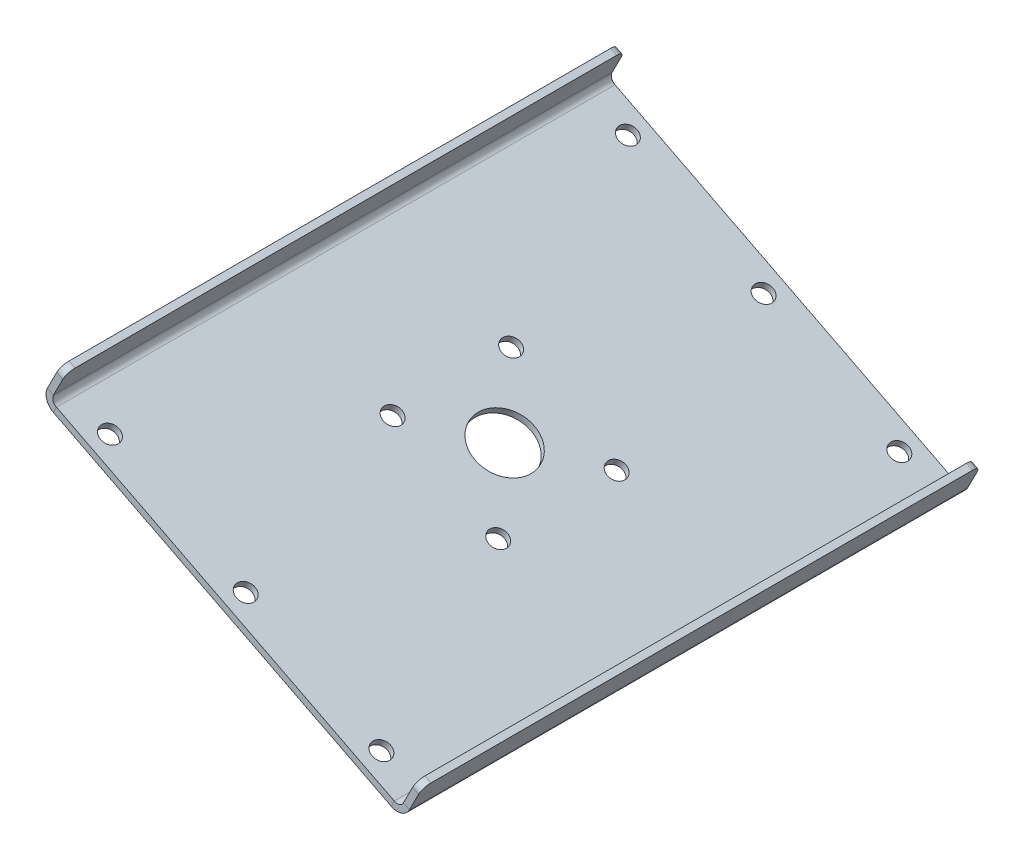
ISO-10303-21;
HEADER;
FILE_DESCRIPTION(('STEP AP214'),'2;1');
FILE_NAME('part.step','',(''),(''),'','','');
FILE_SCHEMA(('AUTOMOTIVE_DESIGN { 1 0 10303 214 1 1 1 1 }'));
ENDSEC;
DATA;
#1=APPLICATION_CONTEXT('core data for automotive mechanical design processes');
#2=APPLICATION_PROTOCOL_DEFINITION('international standard','automotive_design',2000,#1);
#3=PRODUCT_CONTEXT('',#1,'mechanical');
#4=PRODUCT('Part','Part','',(#3));
#5=PRODUCT_RELATED_PRODUCT_CATEGORY('part','',(#4));
#6=PRODUCT_DEFINITION_FORMATION('','',#4);
#7=PRODUCT_DEFINITION_CONTEXT('part definition',#1,'design');
#8=PRODUCT_DEFINITION('design','',#6,#7);
#9=PRODUCT_DEFINITION_SHAPE('','',#8);
#10=(LENGTH_UNIT() NAMED_UNIT(*) SI_UNIT(.MILLI.,.METRE.));
#11=(NAMED_UNIT(*) PLANE_ANGLE_UNIT() SI_UNIT($,.RADIAN.));
#12=(NAMED_UNIT(*) SI_UNIT($,.STERADIAN.) SOLID_ANGLE_UNIT());
#13=UNCERTAINTY_MEASURE_WITH_UNIT(LENGTH_MEASURE(1.E-05),#10,'distance_accuracy_value','');
#14=(GEOMETRIC_REPRESENTATION_CONTEXT(3) GLOBAL_UNCERTAINTY_ASSIGNED_CONTEXT((#13)) GLOBAL_UNIT_ASSIGNED_CONTEXT((#10,
#11,#12)) REPRESENTATION_CONTEXT('',''));
#15=CARTESIAN_POINT('',(0.,0.,0.));
#16=DIRECTION('',(0.,0.,1.));
#17=DIRECTION('',(1.,0.,0.));
#18=AXIS2_PLACEMENT_3D('',#15,#16,#17);
#19=CARTESIAN_POINT('',(1798.40944660311,3785.08922779486,-165.000000000083));
#20=DIRECTION('',(0.453990499739544,0.891006524188369,0.));
#21=DIRECTION('',(0.,0.,1.));
#22=AXIS2_PLACEMENT_3D('',#19,#20,#21);
#23=PLANE('',#22);
#24=DIRECTION('',(0.,0.,1.));
#25=VECTOR('',#24,1.);
#26=CARTESIAN_POINT('',(1798.40944660311,3785.08922779486,-165.000000000083));
#27=LINE('',#26,#25);
#28=CARTESIAN_POINT('',(1798.40944660311,3785.08922779486,159.999999999999));
#29=VERTEX_POINT('',#28);
#30=CARTESIAN_POINT('',(1798.40944660311,3785.08922779486,-160.000000000083));
#31=VERTEX_POINT('',#30);
#32=EDGE_CURVE('E231',#29,#31,#27,.F.);
#33=ORIENTED_EDGE('',*,*,#32,.T.);
#34=DIRECTION('',(0.891006524188369,-0.453990499739545,0.));
#35=VECTOR('',#34,1.);
#36=CARTESIAN_POINT('',(1798.40944660311,3785.08922779486,-160.000000000083));
#37=LINE('',#36,#35);
#38=CARTESIAN_POINT('',(1794.84542050636,3786.90518979382,-160.000000000083));
#39=VERTEX_POINT('',#38);
#40=EDGE_CURVE('E73',#31,#39,#37,.F.);
#41=ORIENTED_EDGE('',*,*,#40,.T.);
#42=DIRECTION('',(0.,0.,1.));
#43=VECTOR('',#42,1.);
#44=CARTESIAN_POINT('',(1794.84542050636,3786.90518979382,-5.86508457625291E-13));
#45=LINE('',#44,#43);
#46=CARTESIAN_POINT('',(1794.84542050636,3786.90518979382,159.999999999999));
#47=VERTEX_POINT('',#46);
#48=EDGE_CURVE('E263',#47,#39,#45,.F.);
#49=ORIENTED_EDGE('',*,*,#48,.F.);
#50=DIRECTION('',(0.891006524188369,-0.453990499739545,0.));
#51=VECTOR('',#50,1.);
#52=CARTESIAN_POINT('',(1798.40944660311,3785.08922779486,159.999999999999));
#53=LINE('',#52,#51);
#54=EDGE_CURVE('E353',#47,#29,#53,.T.);
#55=ORIENTED_EDGE('',*,*,#54,.T.);
#56=EDGE_LOOP('',(#33,#41,#49,#55));
#57=FACE_BOUND('',#56,.T.);
#58=ADVANCED_FACE('F52',(#57),#23,.T.);
#59=CARTESIAN_POINT('',(1798.40944660311,3785.08922779486,164.999999999999));
#60=DIRECTION('',(0.,0.,1.));
#61=DIRECTION('',(-0.453990499739544,-0.891006524188369,0.));
#62=AXIS2_PLACEMENT_3D('',#59,#60,#61);
#63=PLANE('',#62);
#64=DIRECTION('',(-0.453990499739544,-0.891006524188369,0.));
#65=VECTOR('',#64,1.);
#66=CARTESIAN_POINT('',(1798.40944660311,3785.08922779486,164.999999999999));
#67=LINE('',#66,#65);
#68=CARTESIAN_POINT('',(1790.69160810754,3769.94211688366,164.999999999999));
#69=VERTEX_POINT('',#68);
#70=CARTESIAN_POINT('',(1796.13949410442,3780.63419517392,164.999999999999));
#71=VERTEX_POINT('',#70);
#72=EDGE_CURVE('E189',#69,#71,#67,.F.);
#73=ORIENTED_EDGE('',*,*,#72,.T.);
#74=DIRECTION('',(0.891006524188369,-0.453990499739545,0.));
#75=VECTOR('',#74,1.);
#76=CARTESIAN_POINT('',(1796.13949410442,3780.63419517392,164.999999999999));
#77=LINE('',#76,#75);
#78=CARTESIAN_POINT('',(1792.57546800766,3782.45015717288,164.999999999999));
#79=VERTEX_POINT('',#78);
#80=EDGE_CURVE('E13',#71,#79,#77,.F.);
#81=ORIENTED_EDGE('',*,*,#80,.T.);
#82=DIRECTION('',(0.453990499739544,0.891006524188369,0.));
#83=VECTOR('',#82,1.);
#84=CARTESIAN_POINT('',(-106.920782902592,54.4788599687389,164.999999999999));
#85=LINE('',#84,#83);
#86=CARTESIAN_POINT('',(1787.12758201079,3771.75807888261,164.999999999999));
#87=VERTEX_POINT('',#86);
#88=EDGE_CURVE('E249',#87,#79,#85,.T.);
#89=ORIENTED_EDGE('',*,*,#88,.F.);
#90=DIRECTION('',(0.89100652418835,-0.453990499739582,0.));
#91=VECTOR('',#90,1.);
#92=CARTESIAN_POINT('',(1790.69160810754,3769.94211688366,164.999999999999));
#93=LINE('',#92,#91);
#94=EDGE_CURVE('E324',#87,#69,#93,.T.);
#95=ORIENTED_EDGE('',*,*,#94,.T.);
#96=EDGE_LOOP('',(#73,#81,#89,#95));
#97=FACE_BOUND('',#96,.T.);
#98=ADVANCED_FACE('F379',(#97),#63,.T.);
#99=CARTESIAN_POINT('',(1794.2556342043,3768.1261548847,164.999999999999));
#100=DIRECTION('',(0.,0.,-1.));
#101=DIRECTION('',(-1.,0.,0.));
#102=AXIS2_PLACEMENT_3D('',#99,#100,#101);
#103=PLANE('',#102);
#104=ORIENTED_EDGE('',*,*,#94,.F.);
#105=CARTESIAN_POINT('',(1794.2556342043,3768.1261548847,164.999999999999));
#106=DIRECTION('',(0.,0.,1.));
#107=DIRECTION('',(1.,0.,0.));
#108=AXIS2_PLACEMENT_3D('',#105,#106,#107);
#109=CIRCLE('',#108,7.99999999999915);
#110=CARTESIAN_POINT('',(1790.62371020638,3760.99810269119,164.999999999999));
#111=VERTEX_POINT('',#110);
#112=EDGE_CURVE('E262',#87,#111,#109,.T.);
#113=ORIENTED_EDGE('',*,*,#112,.T.);
#114=DIRECTION('',(0.453990499739549,0.891006524188367,0.));
#115=VECTOR('',#114,1.);
#116=CARTESIAN_POINT('',(1792.43967220534,3764.56212878795,164.999999999999));
#117=LINE('',#116,#115);
#118=CARTESIAN_POINT('',(1792.43967220534,3764.56212878795,164.999999999999));
#119=VERTEX_POINT('',#118);
#120=EDGE_CURVE('E322',#111,#119,#117,.T.);
#121=ORIENTED_EDGE('',*,*,#120,.T.);
#122=CARTESIAN_POINT('',(1794.2556342043,3768.1261548847,164.999999999999));
#123=DIRECTION('',(0.,0.,1.));
#124=DIRECTION('',(1.,0.,0.));
#125=AXIS2_PLACEMENT_3D('',#122,#123,#124);
#126=CIRCLE('',#125,3.99999999999915);
#127=EDGE_CURVE('E236',#69,#119,#126,.T.);
#128=ORIENTED_EDGE('',*,*,#127,.F.);
#129=EDGE_LOOP('',(#104,#113,#121,#128));
#130=FACE_BOUND('',#129,.T.);
#131=ADVANCED_FACE('F382',(#130),#103,.F.);
#132=CARTESIAN_POINT('',(1785.31162001183,3768.19405278586,164.999999999999));
#133=DIRECTION('',(0.,0.,-1.));
#134=DIRECTION('',(0.891006524188368,-0.453990499739547,0.));
#135=AXIS2_PLACEMENT_3D('',#132,#133,#134);
#136=PLANE('',#135);
#137=ORIENTED_EDGE('',*,*,#120,.F.);
#138=DIRECTION('',(0.891006524188367,-0.453990499739549,0.));
#139=VECTOR('',#138,1.);
#140=CARTESIAN_POINT('',(1890.41644091548,3710.15116672036,164.999999999999));
#141=LINE('',#140,#139);
#142=CARTESIAN_POINT('',(1990.20917162458,3659.30423074953,165.));
#143=VERTEX_POINT('',#142);
#144=EDGE_CURVE('E243',#111,#143,#141,.T.);
#145=ORIENTED_EDGE('',*,*,#144,.T.);
#146=DIRECTION('',(0.453990499739361,0.891006524188462,0.));
#147=VECTOR('',#146,1.);
#148=CARTESIAN_POINT('',(1992.02513362353,3662.86825684629,165.));
#149=LINE('',#148,#147);
#150=CARTESIAN_POINT('',(1992.02513362353,3662.86825684629,165.));
#151=VERTEX_POINT('',#150);
#152=EDGE_CURVE('E320',#143,#151,#149,.T.);
#153=ORIENTED_EDGE('',*,*,#152,.T.);
#154=DIRECTION('',(0.891006524188368,-0.453990499739547,0.));
#155=VECTOR('',#154,1.);
#156=CARTESIAN_POINT('',(1785.31162001183,3768.19405278586,164.999999999999));
#157=LINE('',#156,#155);
#158=EDGE_CURVE('E203',#119,#151,#157,.T.);
#159=ORIENTED_EDGE('',*,*,#158,.F.);
#160=EDGE_LOOP('',(#137,#145,#153,#159));
#161=FACE_BOUND('',#160,.T.);
#162=ADVANCED_FACE('F395',(#161),#136,.F.);
#163=CARTESIAN_POINT('',(1993.84109562249,3666.43228294304,165.));
#164=DIRECTION('',(0.,0.,1.));
#165=DIRECTION('',(1.,0.,0.));
#166=AXIS2_PLACEMENT_3D('',#163,#164,#165);
#167=PLANE('',#166);
#168=ORIENTED_EDGE('',*,*,#152,.F.);
#169=CARTESIAN_POINT('',(1993.84109562249,3666.43228294304,165.));
#170=DIRECTION('',(0.,0.,-1.));
#171=DIRECTION('',(-1.,0.,0.));
#172=AXIS2_PLACEMENT_3D('',#169,#170,#171);
#173=CIRCLE('',#172,7.99999999999876);
#174=CARTESIAN_POINT('',(2000.969147816,3662.80035894512,165.));
#175=VERTEX_POINT('',#174);
#176=EDGE_CURVE('E266',#143,#175,#173,.F.);
#177=ORIENTED_EDGE('',*,*,#176,.T.);
#178=DIRECTION('',(-0.891006524188365,0.453990499739553,0.));
#179=VECTOR('',#178,1.);
#180=CARTESIAN_POINT('',(1997.40512171924,3664.61632094408,165.));
#181=LINE('',#180,#179);
#182=CARTESIAN_POINT('',(1997.40512171924,3664.61632094408,165.));
#183=VERTEX_POINT('',#182);
#184=EDGE_CURVE('E317',#175,#183,#181,.T.);
#185=ORIENTED_EDGE('',*,*,#184,.T.);
#186=CARTESIAN_POINT('',(1993.84109562249,3666.43228294304,165.));
#187=DIRECTION('',(0.,0.,-1.));
#188=DIRECTION('',(-1.,0.,0.));
#189=AXIS2_PLACEMENT_3D('',#186,#187,#188);
#190=CIRCLE('',#189,3.99999999999876);
#191=EDGE_CURVE('E190',#151,#183,#190,.F.);
#192=ORIENTED_EDGE('',*,*,#191,.F.);
#193=EDGE_LOOP('',(#168,#177,#185,#192));
#194=FACE_BOUND('',#193,.T.);
#195=ADVANCED_FACE('F583',(#194),#167,.T.);
#196=CARTESIAN_POINT('',(1995.58915972029,3661.05229484733,165.));
#197=DIRECTION('',(0.,0.,1.));
#198=DIRECTION('',(0.453990499739553,0.891006524188365,0.));
#199=AXIS2_PLACEMENT_3D('',#196,#197,#198);
#200=PLANE('',#199);
#201=DIRECTION('',(-0.453990499739553,-0.891006524188365,0.));
#202=VECTOR('',#201,1.);
#203=CARTESIAN_POINT('',(106.920782902581,-54.4788599687345,165.));
#204=LINE('',#203,#202);
#205=CARTESIAN_POINT('',(2006.41703381287,3673.49243723539,165.));
#206=VERTEX_POINT('',#205);
#207=EDGE_CURVE('E257',#206,#175,#204,.T.);
#208=ORIENTED_EDGE('',*,*,#207,.F.);
#209=DIRECTION('',(-0.891006524188365,0.453990499739553,0.));
#210=VECTOR('',#209,1.);
#211=CARTESIAN_POINT('',(2002.85300771612,3675.30839923434,165.));
#212=LINE('',#211,#210);
#213=CARTESIAN_POINT('',(2002.85300771612,3675.30839923434,165.));
#214=VERTEX_POINT('',#213);
#215=EDGE_CURVE('E326',#206,#214,#212,.T.);
#216=ORIENTED_EDGE('',*,*,#215,.T.);
#217=DIRECTION('',(0.453990499739553,0.891006524188365,0.));
#218=VECTOR('',#217,1.);
#219=CARTESIAN_POINT('',(1995.58915972029,3661.05229484733,165.));
#220=LINE('',#219,#218);
#221=EDGE_CURVE('E219',#214,#183,#220,.F.);
#222=ORIENTED_EDGE('',*,*,#221,.T.);
#223=ORIENTED_EDGE('',*,*,#184,.F.);
#224=EDGE_LOOP('',(#208,#216,#222,#223));
#225=FACE_BOUND('',#224,.T.);
#226=ADVANCED_FACE('F572',(#225),#200,.T.);
#227=CARTESIAN_POINT('',(2005.12296021482,3679.76343185529,165.));
#228=DIRECTION('',(0.453990499739553,0.891006524188365,0.));
#229=DIRECTION('',(0.,0.,-1.));
#230=AXIS2_PLACEMENT_3D('',#227,#228,#229);
#231=PLANE('',#230);
#232=DIRECTION('',(0.,0.,-1.));
#233=VECTOR('',#232,1.);
#234=CARTESIAN_POINT('',(2005.12296021482,3679.76343185529,165.));
#235=LINE('',#234,#233);
#236=CARTESIAN_POINT('',(2005.12296021482,3679.76343185528,-160.000000000082));
#237=VERTEX_POINT('',#236);
#238=CARTESIAN_POINT('',(2005.12296021482,3679.76343185529,160.));
#239=VERTEX_POINT('',#238);
#240=EDGE_CURVE('E221',#237,#239,#235,.F.);
#241=ORIENTED_EDGE('',*,*,#240,.T.);
#242=DIRECTION('',(-0.891006524188365,0.453990499739553,0.));
#243=VECTOR('',#242,1.);
#244=CARTESIAN_POINT('',(2005.12296021482,3679.76343185529,160.));
#245=LINE('',#244,#243);
#246=CARTESIAN_POINT('',(2008.68698631157,3677.94746985632,160.));
#247=VERTEX_POINT('',#246);
#248=EDGE_CURVE('E338',#239,#247,#245,.F.);
#249=ORIENTED_EDGE('',*,*,#248,.T.);
#250=DIRECTION('',(0.,0.,1.));
#251=VECTOR('',#250,1.);
#252=CARTESIAN_POINT('',(2008.68698631157,3677.94746985632,6.5982201482841E-13));
#253=LINE('',#252,#251);
#254=CARTESIAN_POINT('',(2008.68698631157,3677.94746985632,-160.000000000082));
#255=VERTEX_POINT('',#254);
#256=EDGE_CURVE('E269',#255,#247,#253,.T.);
#257=ORIENTED_EDGE('',*,*,#256,.F.);
#258=DIRECTION('',(-0.891006524188365,0.453990499739553,0.));
#259=VECTOR('',#258,1.);
#260=CARTESIAN_POINT('',(2005.12296021482,3679.76343185528,-160.000000000082));
#261=LINE('',#260,#259);
#262=EDGE_CURVE('E335',#255,#237,#261,.T.);
#263=ORIENTED_EDGE('',*,*,#262,.T.);
#264=EDGE_LOOP('',(#241,#249,#257,#263));
#265=FACE_BOUND('',#264,.T.);
#266=ADVANCED_FACE('F559',(#265),#231,.T.);
#267=CARTESIAN_POINT('',(2005.12296021482,3679.76343185528,-165.000000000082));
#268=DIRECTION('',(0.,0.,-1.));
#269=DIRECTION('',(-0.453990499739553,-0.891006524188365,0.));
#270=AXIS2_PLACEMENT_3D('',#267,#268,#269);
#271=PLANE('',#270);
#272=DIRECTION('',(-0.453990499739553,-0.891006524188365,0.));
#273=VECTOR('',#272,1.);
#274=CARTESIAN_POINT('',(2005.12296021482,3679.76343185528,-165.000000000082));
#275=LINE('',#274,#273);
#276=CARTESIAN_POINT('',(1997.40512171924,3664.61632094408,-165.000000000082));
#277=VERTEX_POINT('',#276);
#278=CARTESIAN_POINT('',(2002.85300771612,3675.30839923434,-165.000000000082));
#279=VERTEX_POINT('',#278);
#280=EDGE_CURVE('E215',#277,#279,#275,.F.);
#281=ORIENTED_EDGE('',*,*,#280,.T.);
#282=DIRECTION('',(-0.891006524188365,0.453990499739553,0.));
#283=VECTOR('',#282,1.);
#284=CARTESIAN_POINT('',(2002.85300771612,3675.30839923434,-165.000000000082));
#285=LINE('',#284,#283);
#286=CARTESIAN_POINT('',(2006.41703381287,3673.49243723538,-165.000000000082));
#287=VERTEX_POINT('',#286);
#288=EDGE_CURVE('E344',#279,#287,#285,.F.);
#289=ORIENTED_EDGE('',*,*,#288,.T.);
#290=DIRECTION('',(-0.453990499739553,-0.891006524188365,0.));
#291=VECTOR('',#290,1.);
#292=CARTESIAN_POINT('',(106.920782902582,-54.4788599687354,-165.000000000082));
#293=LINE('',#292,#291);
#294=CARTESIAN_POINT('',(2000.969147816,3662.80035894512,-165.000000000082));
#295=VERTEX_POINT('',#294);
#296=EDGE_CURVE('E258',#295,#287,#293,.F.);
#297=ORIENTED_EDGE('',*,*,#296,.F.);
#298=DIRECTION('',(-0.891006524188384,0.453990499739516,0.));
#299=VECTOR('',#298,1.);
#300=CARTESIAN_POINT('',(1997.40512171924,3664.61632094408,-165.000000000082));
#301=LINE('',#300,#299);
#302=EDGE_CURVE('E178',#295,#277,#301,.T.);
#303=ORIENTED_EDGE('',*,*,#302,.T.);
#304=EDGE_LOOP('',(#281,#289,#297,#303));
#305=FACE_BOUND('',#304,.T.);
#306=ADVANCED_FACE('F554',(#305),#271,.T.);
#307=CARTESIAN_POINT('',(1993.84109562249,3666.43228294304,-165.000000000082));
#308=DIRECTION('',(0.,0.,1.));
#309=DIRECTION('',(1.,0.,0.));
#310=AXIS2_PLACEMENT_3D('',#307,#308,#309);
#311=PLANE('',#310);
#312=ORIENTED_EDGE('',*,*,#302,.F.);
#313=CARTESIAN_POINT('',(1993.84109562249,3666.43228294304,-165.000000000082));
#314=DIRECTION('',(0.,0.,-1.));
#315=DIRECTION('',(-1.,0.,0.));
#316=AXIS2_PLACEMENT_3D('',#313,#314,#315);
#317=CIRCLE('',#316,7.99999999999876);
#318=CARTESIAN_POINT('',(1990.20917162457,3659.30423074953,-165.000000000082));
#319=VERTEX_POINT('',#318);
#320=EDGE_CURVE('E173',#295,#319,#317,.T.);
#321=ORIENTED_EDGE('',*,*,#320,.T.);
#322=DIRECTION('',(0.453990499739549,0.891006524188367,0.));
#323=VECTOR('',#322,1.);
#324=CARTESIAN_POINT('',(1992.02513362353,3662.86825684629,-165.000000000082));
#325=LINE('',#324,#323);
#326=CARTESIAN_POINT('',(1992.02513362353,3662.86825684629,-165.000000000082));
#327=VERTEX_POINT('',#326);
#328=EDGE_CURVE('E167',#319,#327,#325,.T.);
#329=ORIENTED_EDGE('',*,*,#328,.T.);
#330=CARTESIAN_POINT('',(1993.84109562249,3666.43228294304,-165.000000000082));
#331=DIRECTION('',(0.,0.,-1.));
#332=DIRECTION('',(-1.,0.,0.));
#333=AXIS2_PLACEMENT_3D('',#330,#331,#332);
#334=CIRCLE('',#333,3.99999999999876);
#335=EDGE_CURVE('E170',#277,#327,#334,.T.);
#336=ORIENTED_EDGE('',*,*,#335,.F.);
#337=EDGE_LOOP('',(#312,#321,#329,#336));
#338=FACE_BOUND('',#337,.T.);
#339=ADVANCED_FACE('F169',(#338),#311,.F.);
#340=CARTESIAN_POINT('',(1785.31162001183,3768.19405278586,-165.000000000083));
#341=DIRECTION('',(0.,0.,1.));
#342=DIRECTION('',(-0.891006524188367,0.453990499739549,0.));
#343=AXIS2_PLACEMENT_3D('',#340,#341,#342);
#344=PLANE('',#343);
#345=ORIENTED_EDGE('',*,*,#328,.F.);
#346=DIRECTION('',(0.891006524188367,-0.453990499739549,0.));
#347=VECTOR('',#346,1.);
#348=CARTESIAN_POINT('',(1890.41644091548,3710.15116672036,-165.000000000082));
#349=LINE('',#348,#347);
#350=CARTESIAN_POINT('',(1790.62371020638,3760.99810269119,-165.000000000083));
#351=VERTEX_POINT('',#350);
#352=EDGE_CURVE('E244',#319,#351,#349,.F.);
#353=ORIENTED_EDGE('',*,*,#352,.T.);
#354=DIRECTION('',(0.453990499739715,0.891006524188282,0.));
#355=VECTOR('',#354,1.);
#356=CARTESIAN_POINT('',(1792.43967220534,3764.56212878795,-165.000000000083));
#357=LINE('',#356,#355);
#358=CARTESIAN_POINT('',(1792.43967220534,3764.56212878795,-165.000000000083));
#359=VERTEX_POINT('',#358);
#360=EDGE_CURVE('E179',#351,#359,#357,.T.);
#361=ORIENTED_EDGE('',*,*,#360,.T.);
#362=DIRECTION('',(-0.891006524188367,0.453990499739549,0.));
#363=VECTOR('',#362,1.);
#364=CARTESIAN_POINT('',(1785.31162001183,3768.19405278586,-165.000000000083));
#365=LINE('',#364,#363);
#366=EDGE_CURVE('E193',#327,#359,#365,.T.);
#367=ORIENTED_EDGE('',*,*,#366,.F.);
#368=EDGE_LOOP('',(#345,#353,#361,#367));
#369=FACE_BOUND('',#368,.T.);
#370=ADVANCED_FACE('F194',(#369),#344,.F.);
#371=CARTESIAN_POINT('',(1794.2556342043,3768.1261548847,-165.000000000083));
#372=DIRECTION('',(0.,0.,-1.));
#373=DIRECTION('',(-1.,0.,0.));
#374=AXIS2_PLACEMENT_3D('',#371,#372,#373);
#375=PLANE('',#374);
#376=ORIENTED_EDGE('',*,*,#360,.F.);
#377=CARTESIAN_POINT('',(1794.2556342043,3768.1261548847,-165.000000000083));
#378=DIRECTION('',(0.,0.,1.));
#379=DIRECTION('',(1.,0.,0.));
#380=AXIS2_PLACEMENT_3D('',#377,#378,#379);
#381=CIRCLE('',#380,7.99999999999915);
#382=CARTESIAN_POINT('',(1787.12758201079,3771.75807888261,-165.000000000083));
#383=VERTEX_POINT('',#382);
#384=EDGE_CURVE('E259',#351,#383,#381,.F.);
#385=ORIENTED_EDGE('',*,*,#384,.T.);
#386=DIRECTION('',(0.891006524188369,-0.453990499739545,0.));
#387=VECTOR('',#386,1.);
#388=CARTESIAN_POINT('',(1790.69160810754,3769.94211688366,-165.000000000083));
#389=LINE('',#388,#387);
#390=CARTESIAN_POINT('',(1790.69160810754,3769.94211688366,-165.000000000083));
#391=VERTEX_POINT('',#390);
#392=EDGE_CURVE('E239',#383,#391,#389,.T.);
#393=ORIENTED_EDGE('',*,*,#392,.T.);
#394=CARTESIAN_POINT('',(1794.2556342043,3768.1261548847,-165.000000000083));
#395=DIRECTION('',(0.,0.,1.));
#396=DIRECTION('',(1.,0.,0.));
#397=AXIS2_PLACEMENT_3D('',#394,#395,#396);
#398=CIRCLE('',#397,3.99999999999915);
#399=EDGE_CURVE('E233',#359,#391,#398,.F.);
#400=ORIENTED_EDGE('',*,*,#399,.F.);
#401=EDGE_LOOP('',(#376,#385,#393,#400));
#402=FACE_BOUND('',#401,.T.);
#403=ADVANCED_FACE('F388',(#402),#375,.T.);
#404=CARTESIAN_POINT('',(1861.04717456785,3729.604860308,-35.00000000004));
#405=DIRECTION('',(0.453990499739549,0.891006524188367,0.));
#406=DIRECTION('',(-0.891006524188367,0.453990499739549,0.));
#407=AXIS2_PLACEMENT_3D('',#404,#405,#406);
#408=CYLINDRICAL_SURFACE('',#407,5.49999999999999);
#409=CARTESIAN_POINT('',(1861.04717456785,3729.604860308,-35.00000000004));
#410=DIRECTION('',(0.453990499739549,0.891006524188367,0.));
#411=DIRECTION('',(-0.891006524188367,0.453990499739549,0.));
#412=AXIS2_PLACEMENT_3D('',#409,#410,#411);
#413=CIRCLE('',#412,5.49999999999999);
#414=CARTESIAN_POINT('',(1856.14663868481,3732.10180805657,-35.00000000004));
#415=VERTEX_POINT('',#414);
#416=EDGE_CURVE('E279',#415,#415,#413,.T.);
#417=ORIENTED_EDGE('',*,*,#416,.T.);
#418=EDGE_LOOP('',(#417));
#419=FACE_BOUND('',#418,.T.);
#420=CARTESIAN_POINT('',(1859.23121256889,3726.04083421125,-35.00000000004));
#421=DIRECTION('',(0.453990499739549,0.891006524188367,0.));
#422=DIRECTION('',(-0.891006524188367,0.453990499739549,0.));
#423=AXIS2_PLACEMENT_3D('',#420,#421,#422);
#424=CIRCLE('',#423,5.49999999999999);
#425=CARTESIAN_POINT('',(1854.33067668585,3728.53778195981,-35.00000000004));
#426=VERTEX_POINT('',#425);
#427=EDGE_CURVE('E283',#426,#426,#424,.T.);
#428=ORIENTED_EDGE('',*,*,#427,.F.);
#429=EDGE_LOOP('',(#428));
#430=FACE_BOUND('',#429,.T.);
#431=ADVANCED_FACE('F416',(#419,#430),#408,.F.);
#432=CARTESIAN_POINT('',(1861.04717456785,3729.604860308,34.99999999996));
#433=DIRECTION('',(0.453990499739549,0.891006524188367,0.));
#434=DIRECTION('',(-0.891006524188367,0.453990499739549,0.));
#435=AXIS2_PLACEMENT_3D('',#432,#433,#434);
#436=CYLINDRICAL_SURFACE('',#435,5.49999999999999);
#437=CARTESIAN_POINT('',(1861.04717456785,3729.604860308,34.99999999996));
#438=DIRECTION('',(0.453990499739549,0.891006524188367,0.));
#439=DIRECTION('',(-0.891006524188367,0.453990499739549,0.));
#440=AXIS2_PLACEMENT_3D('',#437,#438,#439);
#441=CIRCLE('',#440,5.49999999999999);
#442=CARTESIAN_POINT('',(1856.14663868481,3732.10180805657,34.99999999996));
#443=VERTEX_POINT('',#442);
#444=EDGE_CURVE('E860',#443,#443,#441,.T.);
#445=ORIENTED_EDGE('',*,*,#444,.T.);
#446=EDGE_LOOP('',(#445));
#447=FACE_BOUND('',#446,.T.);
#448=CARTESIAN_POINT('',(1859.23121256889,3726.04083421125,34.9999999999601));
#449=DIRECTION('',(0.453990499739549,0.891006524188367,0.));
#450=DIRECTION('',(-0.891006524188367,0.453990499739549,0.));
#451=AXIS2_PLACEMENT_3D('',#448,#449,#450);
#452=CIRCLE('',#451,5.49999999999999);
#453=CARTESIAN_POINT('',(1854.33067668585,3728.53778195981,34.9999999999601));
#454=VERTEX_POINT('',#453);
#455=EDGE_CURVE('E286',#454,#454,#452,.T.);
#456=ORIENTED_EDGE('',*,*,#455,.F.);
#457=EDGE_LOOP('',(#456));
#458=FACE_BOUND('',#457,.T.);
#459=ADVANCED_FACE('F419',(#447,#458),#436,.F.);
#460=CARTESIAN_POINT('',(1923.41763126103,3697.82552532623,34.99999999996));
#461=DIRECTION('',(0.453990499739549,0.891006524188367,0.));
#462=DIRECTION('',(-0.891006524188367,0.453990499739549,0.));
#463=AXIS2_PLACEMENT_3D('',#460,#461,#462);
#464=CYLINDRICAL_SURFACE('',#463,5.49999999999999);
#465=CARTESIAN_POINT('',(1923.41763126103,3697.82552532623,34.99999999996));
#466=DIRECTION('',(0.453990499739549,0.891006524188367,0.));
#467=DIRECTION('',(-0.891006524188367,0.453990499739549,0.));
#468=AXIS2_PLACEMENT_3D('',#465,#466,#467);
#469=CIRCLE('',#468,5.49999999999999);
#470=CARTESIAN_POINT('',(1918.517095378,3700.3224730748,34.99999999996));
#471=VERTEX_POINT('',#470);
#472=EDGE_CURVE('E864',#471,#471,#469,.T.);
#473=ORIENTED_EDGE('',*,*,#472,.T.);
#474=EDGE_LOOP('',(#473));
#475=FACE_BOUND('',#474,.T.);
#476=CARTESIAN_POINT('',(1921.60166926207,3694.26149922948,34.9999999999601));
#477=DIRECTION('',(0.453990499739549,0.891006524188367,0.));
#478=DIRECTION('',(-0.891006524188367,0.453990499739549,0.));
#479=AXIS2_PLACEMENT_3D('',#476,#477,#478);
#480=CIRCLE('',#479,5.49999999999999);
#481=CARTESIAN_POINT('',(1916.70113337904,3696.75844697805,34.9999999999601));
#482=VERTEX_POINT('',#481);
#483=EDGE_CURVE('E289',#482,#482,#480,.T.);
#484=ORIENTED_EDGE('',*,*,#483,.F.);
#485=EDGE_LOOP('',(#484));
#486=FACE_BOUND('',#485,.T.);
#487=ADVANCED_FACE('F423',(#475,#486),#464,.F.);
#488=CARTESIAN_POINT('',(1923.41763126103,3697.82552532623,-35.00000000004));
#489=DIRECTION('',(0.453990499739549,0.891006524188367,0.));
#490=DIRECTION('',(-0.891006524188367,0.453990499739549,0.));
#491=AXIS2_PLACEMENT_3D('',#488,#489,#490);
#492=CYLINDRICAL_SURFACE('',#491,5.49999999999999);
#493=CARTESIAN_POINT('',(1923.41763126103,3697.82552532623,-35.00000000004));
#494=DIRECTION('',(0.453990499739549,0.891006524188367,0.));
#495=DIRECTION('',(-0.891006524188367,0.453990499739549,0.));
#496=AXIS2_PLACEMENT_3D('',#493,#494,#495);
#497=CIRCLE('',#496,5.49999999999999);
#498=CARTESIAN_POINT('',(1918.517095378,3700.3224730748,-35.00000000004));
#499=VERTEX_POINT('',#498);
#500=EDGE_CURVE('E868',#499,#499,#497,.T.);
#501=ORIENTED_EDGE('',*,*,#500,.T.);
#502=EDGE_LOOP('',(#501));
#503=FACE_BOUND('',#502,.T.);
#504=CARTESIAN_POINT('',(1921.60166926207,3694.26149922948,-35.00000000004));
#505=DIRECTION('',(0.453990499739549,0.891006524188367,0.));
#506=DIRECTION('',(-0.891006524188367,0.453990499739549,0.));
#507=AXIS2_PLACEMENT_3D('',#504,#505,#506);
#508=CIRCLE('',#507,5.49999999999999);
#509=CARTESIAN_POINT('',(1916.70113337904,3696.75844697804,-35.00000000004));
#510=VERTEX_POINT('',#509);
#511=EDGE_CURVE('E292',#510,#510,#508,.T.);
#512=ORIENTED_EDGE('',*,*,#511,.F.);
#513=EDGE_LOOP('',(#512));
#514=FACE_BOUND('',#513,.T.);
#515=ADVANCED_FACE('F427',(#503,#514),#492,.F.);
#516=CARTESIAN_POINT('',(1892.23240291444,3713.71519281712,-3.99811114081434E-11));
#517=DIRECTION('',(0.453990499739549,0.891006524188367,0.));
#518=DIRECTION('',(-0.891006524188367,0.453990499739549,0.));
#519=AXIS2_PLACEMENT_3D('',#516,#517,#518);
#520=CYLINDRICAL_SURFACE('',#519,17.4999999999999);
#521=CARTESIAN_POINT('',(1892.23240291444,3713.71519281712,-3.99811114081434E-11));
#522=DIRECTION('',(0.453990499739549,0.891006524188367,0.));
#523=DIRECTION('',(-0.891006524188367,0.453990499739549,0.));
#524=AXIS2_PLACEMENT_3D('',#521,#522,#523);
#525=CIRCLE('',#524,17.4999999999999);
#526=CARTESIAN_POINT('',(1876.63978874114,3721.66002656256,-3.99811114081434E-11));
#527=VERTEX_POINT('',#526);
#528=EDGE_CURVE('E872',#527,#527,#525,.T.);
#529=ORIENTED_EDGE('',*,*,#528,.T.);
#530=EDGE_LOOP('',(#529));
#531=FACE_BOUND('',#530,.T.);
#532=CARTESIAN_POINT('',(1890.41644091548,3710.15116672036,-3.994274181946E-11));
#533=DIRECTION('',(0.453990499739549,0.891006524188367,0.));
#534=DIRECTION('',(-0.891006524188367,0.453990499739549,0.));
#535=AXIS2_PLACEMENT_3D('',#532,#533,#534);
#536=CIRCLE('',#535,17.4999999999999);
#537=CARTESIAN_POINT('',(1874.82382674218,3718.0960004658,-3.994274181946E-11));
#538=VERTEX_POINT('',#537);
#539=EDGE_CURVE('E295',#538,#538,#536,.T.);
#540=ORIENTED_EDGE('',*,*,#539,.F.);
#541=EDGE_LOOP('',(#540));
#542=FACE_BOUND('',#541,.T.);
#543=ADVANCED_FACE('F431',(#531,#542),#520,.F.);
#544=CARTESIAN_POINT('',(1972.42299009139,3672.85604784056,152.999999999998));
#545=DIRECTION('',(-0.453990499739549,-0.891006524188367,0.));
#546=DIRECTION('',(0.891006524188367,-0.453990499739549,0.));
#547=AXIS2_PLACEMENT_3D('',#544,#545,#546);
#548=CYLINDRICAL_SURFACE('',#547,5.50000000000001);
#549=CARTESIAN_POINT('',(1972.42299009139,3672.85604784056,152.999999999998));
#550=DIRECTION('',(-0.453990499739549,-0.891006524188367,0.));
#551=DIRECTION('',(0.891006524188367,-0.453990499739549,0.));
#552=AXIS2_PLACEMENT_3D('',#549,#550,#551);
#553=CIRCLE('',#552,5.50000000000001);
#554=CARTESIAN_POINT('',(1977.32352597443,3670.35910009199,152.999999999998));
#555=VERTEX_POINT('',#554);
#556=EDGE_CURVE('E876',#555,#555,#553,.T.);
#557=ORIENTED_EDGE('',*,*,#556,.F.);
#558=EDGE_LOOP('',(#557));
#559=FACE_BOUND('',#558,.T.);
#560=CARTESIAN_POINT('',(1970.60702809243,3669.2920217438,152.999999999998));
#561=DIRECTION('',(-0.453990499739549,-0.891006524188367,0.));
#562=DIRECTION('',(0.891006524188367,-0.453990499739549,0.));
#563=AXIS2_PLACEMENT_3D('',#560,#561,#562);
#564=CIRCLE('',#563,5.50000000000001);
#565=CARTESIAN_POINT('',(1975.50756397547,3666.79507399524,152.999999999998));
#566=VERTEX_POINT('',#565);
#567=EDGE_CURVE('E298',#566,#566,#564,.T.);
#568=ORIENTED_EDGE('',*,*,#567,.T.);
#569=EDGE_LOOP('',(#568));
#570=FACE_BOUND('',#569,.T.);
#571=ADVANCED_FACE('F435',(#559,#570),#548,.F.);
#572=CARTESIAN_POINT('',(1892.23240291444,3713.71519281712,152.999999999998));
#573=DIRECTION('',(-0.453990499739549,-0.891006524188367,0.));
#574=DIRECTION('',(0.891006524188367,-0.453990499739549,0.));
#575=AXIS2_PLACEMENT_3D('',#572,#573,#574);
#576=CYLINDRICAL_SURFACE('',#575,5.49999999999999);
#577=CARTESIAN_POINT('',(1892.23240291444,3713.71519281712,152.999999999998));
#578=DIRECTION('',(-0.453990499739549,-0.891006524188367,0.));
#579=DIRECTION('',(0.891006524188367,-0.453990499739549,0.));
#580=AXIS2_PLACEMENT_3D('',#577,#578,#579);
#581=CIRCLE('',#580,5.49999999999999);
#582=CARTESIAN_POINT('',(1897.13293879747,3711.21824506855,152.999999999998));
#583=VERTEX_POINT('',#582);
#584=EDGE_CURVE('E880',#583,#583,#581,.T.);
#585=ORIENTED_EDGE('',*,*,#584,.F.);
#586=EDGE_LOOP('',(#585));
#587=FACE_BOUND('',#586,.T.);
#588=CARTESIAN_POINT('',(1890.41644091548,3710.15116672036,152.999999999998));
#589=DIRECTION('',(-0.453990499739549,-0.891006524188367,0.));
#590=DIRECTION('',(0.891006524188367,-0.453990499739549,0.));
#591=AXIS2_PLACEMENT_3D('',#588,#589,#590);
#592=CIRCLE('',#591,5.49999999999999);
#593=CARTESIAN_POINT('',(1895.31697679851,3707.6542189718,152.999999999998));
#594=VERTEX_POINT('',#593);
#595=EDGE_CURVE('E301',#594,#594,#592,.T.);
#596=ORIENTED_EDGE('',*,*,#595,.T.);
#597=EDGE_LOOP('',(#596));
#598=FACE_BOUND('',#597,.T.);
#599=ADVANCED_FACE('F439',(#587,#598),#576,.F.);
#600=CARTESIAN_POINT('',(1812.04181573748,3754.57433779368,152.999999999998));
#601=DIRECTION('',(-0.453990499739549,-0.891006524188367,0.));
#602=DIRECTION('',(0.891006524188367,-0.453990499739549,0.));
#603=AXIS2_PLACEMENT_3D('',#600,#601,#602);
#604=CYLINDRICAL_SURFACE('',#603,5.50000000000001);
#605=CARTESIAN_POINT('',(1812.04181573748,3754.57433779368,152.999999999998));
#606=DIRECTION('',(-0.453990499739549,-0.891006524188367,0.));
#607=DIRECTION('',(0.891006524188367,-0.453990499739549,0.));
#608=AXIS2_PLACEMENT_3D('',#605,#606,#607);
#609=CIRCLE('',#608,5.50000000000001);
#610=CARTESIAN_POINT('',(1816.94235162052,3752.07739004511,152.999999999998));
#611=VERTEX_POINT('',#610);
#612=EDGE_CURVE('E884',#611,#611,#609,.T.);
#613=ORIENTED_EDGE('',*,*,#612,.F.);
#614=EDGE_LOOP('',(#613));
#615=FACE_BOUND('',#614,.T.);
#616=CARTESIAN_POINT('',(1810.22585373852,3751.01031169692,152.999999999998));
#617=DIRECTION('',(-0.453990499739549,-0.891006524188367,0.));
#618=DIRECTION('',(0.891006524188367,-0.453990499739549,0.));
#619=AXIS2_PLACEMENT_3D('',#616,#617,#618);
#620=CIRCLE('',#619,5.50000000000001);
#621=CARTESIAN_POINT('',(1815.12638962156,3748.51336394836,152.999999999998));
#622=VERTEX_POINT('',#621);
#623=EDGE_CURVE('E304',#622,#622,#620,.T.);
#624=ORIENTED_EDGE('',*,*,#623,.T.);
#625=EDGE_LOOP('',(#624));
#626=FACE_BOUND('',#625,.T.);
#627=ADVANCED_FACE('F443',(#615,#626),#604,.F.);
#628=CARTESIAN_POINT('',(1812.04181573748,3754.57433779367,-153.000000000081));
#629=DIRECTION('',(-0.453990499739549,-0.891006524188367,0.));
#630=DIRECTION('',(0.891006524188367,-0.453990499739549,0.));
#631=AXIS2_PLACEMENT_3D('',#628,#629,#630);
#632=CYLINDRICAL_SURFACE('',#631,5.50000000012931);
#633=CARTESIAN_POINT('',(1812.04181573748,3754.57433779367,-153.000000000081));
#634=DIRECTION('',(-0.453990499739549,-0.891006524188367,0.));
#635=DIRECTION('',(0.891006524188367,-0.453990499739549,0.));
#636=AXIS2_PLACEMENT_3D('',#633,#634,#635);
#637=CIRCLE('',#636,5.50000000012931);
#638=CARTESIAN_POINT('',(1816.94235162063,3752.07739004505,-153.000000000081));
#639=VERTEX_POINT('',#638);
#640=EDGE_CURVE('E888',#639,#639,#637,.T.);
#641=ORIENTED_EDGE('',*,*,#640,.F.);
#642=EDGE_LOOP('',(#641));
#643=FACE_BOUND('',#642,.T.);
#644=CARTESIAN_POINT('',(1810.22585373852,3751.01031169692,-153.000000000081));
#645=DIRECTION('',(-0.453990499739549,-0.891006524188367,0.));
#646=DIRECTION('',(0.891006524188367,-0.453990499739549,0.));
#647=AXIS2_PLACEMENT_3D('',#644,#645,#646);
#648=CIRCLE('',#647,5.50000000012931);
#649=CARTESIAN_POINT('',(1815.12638962168,3748.51336394829,-153.000000000081));
#650=VERTEX_POINT('',#649);
#651=EDGE_CURVE('E307',#650,#650,#648,.T.);
#652=ORIENTED_EDGE('',*,*,#651,.T.);
#653=EDGE_LOOP('',(#652));
#654=FACE_BOUND('',#653,.T.);
#655=ADVANCED_FACE('F447',(#643,#654),#632,.F.);
#656=CARTESIAN_POINT('',(1892.23240291444,3713.71519281711,-153.00000000008));
#657=DIRECTION('',(-0.453990499739549,-0.891006524188367,0.));
#658=DIRECTION('',(0.891006524188367,-0.453990499739549,0.));
#659=AXIS2_PLACEMENT_3D('',#656,#657,#658);
#660=CYLINDRICAL_SURFACE('',#659,5.50000000010585);
#661=CARTESIAN_POINT('',(1892.23240291444,3713.71519281711,-153.00000000008));
#662=DIRECTION('',(-0.453990499739549,-0.891006524188367,0.));
#663=DIRECTION('',(0.891006524188367,-0.453990499739549,0.));
#664=AXIS2_PLACEMENT_3D('',#661,#662,#663);
#665=CIRCLE('',#664,5.50000000010585);
#666=CARTESIAN_POINT('',(1897.13293879757,3711.2182450685,-153.00000000008));
#667=VERTEX_POINT('',#666);
#668=EDGE_CURVE('E208',#667,#667,#665,.T.);
#669=ORIENTED_EDGE('',*,*,#668,.F.);
#670=EDGE_LOOP('',(#669));
#671=FACE_BOUND('',#670,.T.);
#672=CARTESIAN_POINT('',(1890.41644091548,3710.15116672036,-153.00000000008));
#673=DIRECTION('',(-0.453990499739549,-0.891006524188367,0.));
#674=DIRECTION('',(0.891006524188367,-0.453990499739549,0.));
#675=AXIS2_PLACEMENT_3D('',#672,#673,#674);
#676=CIRCLE('',#675,5.50000000010585);
#677=CARTESIAN_POINT('',(1895.31697679861,3707.65421897174,-153.00000000008));
#678=VERTEX_POINT('',#677);
#679=EDGE_CURVE('E310',#678,#678,#676,.T.);
#680=ORIENTED_EDGE('',*,*,#679,.T.);
#681=EDGE_LOOP('',(#680));
#682=FACE_BOUND('',#681,.T.);
#683=ADVANCED_FACE('F451',(#671,#682),#660,.F.);
#684=CARTESIAN_POINT('',(1972.42299009139,3672.85604784055,-153.000000000079));
#685=DIRECTION('',(-0.453990499739549,-0.891006524188367,0.));
#686=DIRECTION('',(0.891006524188367,-0.453990499739549,0.));
#687=AXIS2_PLACEMENT_3D('',#684,#685,#686);
#688=CYLINDRICAL_SURFACE('',#687,5.5000000000828);
#689=CARTESIAN_POINT('',(1972.42299009139,3672.85604784055,-153.000000000079));
#690=DIRECTION('',(-0.453990499739549,-0.891006524188367,0.));
#691=DIRECTION('',(0.891006524188367,-0.453990499739549,0.));
#692=AXIS2_PLACEMENT_3D('',#689,#690,#691);
#693=CIRCLE('',#692,5.5000000000828);
#694=CARTESIAN_POINT('',(1977.3235259745,3670.35910009195,-153.000000000079));
#695=VERTEX_POINT('',#694);
#696=EDGE_CURVE('E205',#695,#695,#693,.T.);
#697=ORIENTED_EDGE('',*,*,#696,.F.);
#698=EDGE_LOOP('',(#697));
#699=FACE_BOUND('',#698,.T.);
#700=CARTESIAN_POINT('',(1970.60702809243,3669.2920217438,-153.000000000079));
#701=DIRECTION('',(-0.453990499739549,-0.891006524188367,0.));
#702=DIRECTION('',(0.891006524188367,-0.453990499739549,0.));
#703=AXIS2_PLACEMENT_3D('',#700,#701,#702);
#704=CIRCLE('',#703,5.5000000000828);
#705=CARTESIAN_POINT('',(1975.50756397554,3666.7950739952,-153.000000000079));
#706=VERTEX_POINT('',#705);
#707=EDGE_CURVE('E253',#706,#706,#704,.T.);
#708=ORIENTED_EDGE('',*,*,#707,.T.);
#709=EDGE_LOOP('',(#708));
#710=FACE_BOUND('',#709,.T.);
#711=ADVANCED_FACE('F405',(#699,#710),#688,.F.);
#712=CARTESIAN_POINT('',(1788.87564610858,3766.3780907869,-165.000000000083));
#713=DIRECTION('',(0.,0.,-1.));
#714=DIRECTION('',(0.453990499739544,0.891006524188369,0.));
#715=AXIS2_PLACEMENT_3D('',#712,#713,#714);
#716=PLANE('',#715);
#717=DIRECTION('',(0.453990499739544,0.891006524188369,0.));
#718=VECTOR('',#717,1.);
#719=CARTESIAN_POINT('',(-106.92078290259,54.4788599687381,-165.000000000083));
#720=LINE('',#719,#718);
#721=CARTESIAN_POINT('',(1792.57546800766,3782.45015717287,-165.000000000083));
#722=VERTEX_POINT('',#721);
#723=EDGE_CURVE('E248',#722,#383,#720,.F.);
#724=ORIENTED_EDGE('',*,*,#723,.F.);
#725=DIRECTION('',(0.891006524188369,-0.453990499739545,0.));
#726=VECTOR('',#725,1.);
#727=CARTESIAN_POINT('',(1796.13949410442,3780.63419517392,-165.000000000083));
#728=LINE('',#727,#726);
#729=CARTESIAN_POINT('',(1796.13949410442,3780.63419517392,-165.000000000083));
#730=VERTEX_POINT('',#729);
#731=EDGE_CURVE('E346',#722,#730,#728,.T.);
#732=ORIENTED_EDGE('',*,*,#731,.T.);
#733=DIRECTION('',(0.453990499739544,0.891006524188369,0.));
#734=VECTOR('',#733,1.);
#735=CARTESIAN_POINT('',(1788.87564610858,3766.3780907869,-165.000000000083));
#736=LINE('',#735,#734);
#737=EDGE_CURVE('E229',#730,#391,#736,.F.);
#738=ORIENTED_EDGE('',*,*,#737,.T.);
#739=ORIENTED_EDGE('',*,*,#392,.F.);
#740=EDGE_LOOP('',(#724,#732,#738,#739));
#741=FACE_BOUND('',#740,.T.);
#742=ADVANCED_FACE('F366',(#741),#716,.T.);
#743=CARTESIAN_POINT('',(1794.2556342043,3768.1261548847,164.999999999999));
#744=DIRECTION('',(0.,0.,1.));
#745=DIRECTION('',(-0.891006524188369,0.453990499739544,0.));
#746=AXIS2_PLACEMENT_3D('',#743,#744,#745);
#747=CYLINDRICAL_SURFACE('',#746,3.99999999999915);
#748=DIRECTION('',(0.,0.,1.));
#749=VECTOR('',#748,1.);
#750=CARTESIAN_POINT('',(1792.43967220534,3764.56212878795,164.999999999999));
#751=LINE('',#750,#749);
#752=EDGE_CURVE('E198',#119,#359,#751,.F.);
#753=ORIENTED_EDGE('',*,*,#752,.T.);
#754=ORIENTED_EDGE('',*,*,#399,.T.);
#755=DIRECTION('',(0.,0.,1.));
#756=VECTOR('',#755,1.);
#757=CARTESIAN_POINT('',(1790.69160810754,3769.94211688366,-165.000000000083));
#758=LINE('',#757,#756);
#759=EDGE_CURVE('E226',#391,#69,#758,.T.);
#760=ORIENTED_EDGE('',*,*,#759,.T.);
#761=ORIENTED_EDGE('',*,*,#127,.T.);
#762=EDGE_LOOP('',(#753,#754,#760,#761));
#763=FACE_BOUND('',#762,.T.);
#764=ADVANCED_FACE('F397',(#763),#747,.F.);
#765=CARTESIAN_POINT('',(-103.356756805837,52.6628979697803,-5.66958175704446E-13));
#766=DIRECTION('',(0.891006524188369,-0.453990499739545,0.));
#767=DIRECTION('',(0.453990499739544,0.891006524188369,0.));
#768=AXIS2_PLACEMENT_3D('',#765,#766,#767);
#769=PLANE('',#768);
#770=ORIENTED_EDGE('',*,*,#737,.F.);
#771=CARTESIAN_POINT('',(1796.13949410442,3780.63419517392,-160.000000000083));
#772=DIRECTION('',(0.891006524188369,-0.453990499739545,0.));
#773=DIRECTION('',(0.453990499739544,0.891006524188369,0.));
#774=AXIS2_PLACEMENT_3D('',#771,#772,#773);
#775=CIRCLE('',#774,5.);
#776=EDGE_CURVE('E351',#730,#31,#775,.T.);
#777=ORIENTED_EDGE('',*,*,#776,.T.);
#778=ORIENTED_EDGE('',*,*,#32,.F.);
#779=CARTESIAN_POINT('',(1796.13949410442,3780.63419517392,159.999999999999));
#780=DIRECTION('',(0.891006524188369,-0.453990499739545,0.));
#781=DIRECTION('',(0.453990499739544,0.891006524188369,0.));
#782=AXIS2_PLACEMENT_3D('',#779,#780,#781);
#783=CIRCLE('',#782,5.);
#784=EDGE_CURVE('E349',#29,#71,#783,.T.);
#785=ORIENTED_EDGE('',*,*,#784,.T.);
#786=ORIENTED_EDGE('',*,*,#72,.F.);
#787=ORIENTED_EDGE('',*,*,#759,.F.);
#788=EDGE_LOOP('',(#770,#777,#778,#785,#786,#787));
#789=FACE_BOUND('',#788,.T.);
#790=ADVANCED_FACE('F372',(#789),#769,.T.);
#791=CARTESIAN_POINT('',(1993.84109562249,3666.43228294304,-165.000000000082));
#792=DIRECTION('',(0.,0.,-1.));
#793=DIRECTION('',(0.891006524188365,-0.453990499739553,0.));
#794=AXIS2_PLACEMENT_3D('',#791,#792,#793);
#795=CYLINDRICAL_SURFACE('',#794,3.99999999999876);
#796=DIRECTION('',(0.,0.,-1.));
#797=VECTOR('',#796,1.);
#798=CARTESIAN_POINT('',(1992.02513362353,3662.86825684629,-165.000000000082));
#799=LINE('',#798,#797);
#800=EDGE_CURVE('E186',#327,#151,#799,.F.);
#801=ORIENTED_EDGE('',*,*,#800,.T.);
#802=ORIENTED_EDGE('',*,*,#191,.T.);
#803=DIRECTION('',(0.,0.,-1.));
#804=VECTOR('',#803,1.);
#805=CARTESIAN_POINT('',(1997.40512171924,3664.61632094408,165.));
#806=LINE('',#805,#804);
#807=EDGE_CURVE('E188',#183,#277,#806,.T.);
#808=ORIENTED_EDGE('',*,*,#807,.T.);
#809=ORIENTED_EDGE('',*,*,#335,.T.);
#810=EDGE_LOOP('',(#801,#802,#808,#809));
#811=FACE_BOUND('',#810,.T.);
#812=ADVANCED_FACE('F183',(#811),#795,.F.);
#813=CARTESIAN_POINT('',(103.356756805828,-52.6628979697767,6.37827947667458E-13));
#814=DIRECTION('',(-0.891006524188365,0.453990499739553,0.));
#815=DIRECTION('',(-0.453990499739553,-0.891006524188365,0.));
#816=AXIS2_PLACEMENT_3D('',#813,#814,#815);
#817=PLANE('',#816);
#818=ORIENTED_EDGE('',*,*,#221,.F.);
#819=CARTESIAN_POINT('',(2002.85300771612,3675.30839923434,160.));
#820=DIRECTION('',(-0.891006524188365,0.453990499739553,0.));
#821=DIRECTION('',(-0.453990499739553,-0.891006524188365,0.));
#822=AXIS2_PLACEMENT_3D('',#819,#820,#821);
#823=CIRCLE('',#822,5.);
#824=EDGE_CURVE('E333',#214,#239,#823,.T.);
#825=ORIENTED_EDGE('',*,*,#824,.T.);
#826=ORIENTED_EDGE('',*,*,#240,.F.);
#827=CARTESIAN_POINT('',(2002.85300771612,3675.30839923434,-160.000000000082));
#828=DIRECTION('',(-0.891006524188365,0.453990499739553,0.));
#829=DIRECTION('',(-0.453990499739553,-0.891006524188365,0.));
#830=AXIS2_PLACEMENT_3D('',#827,#828,#829);
#831=CIRCLE('',#830,5.);
#832=EDGE_CURVE('E331',#237,#279,#831,.T.);
#833=ORIENTED_EDGE('',*,*,#832,.T.);
#834=ORIENTED_EDGE('',*,*,#280,.F.);
#835=ORIENTED_EDGE('',*,*,#807,.F.);
#836=EDGE_LOOP('',(#818,#825,#826,#833,#834,#835));
#837=FACE_BOUND('',#836,.T.);
#838=ADVANCED_FACE('F524',(#837),#817,.T.);
#839=CARTESIAN_POINT('',(1892.23240291444,3713.71519281711,-3.99823104577898E-11));
#840=DIRECTION('',(-0.453990499739549,-0.891006524188367,0.));
#841=DIRECTION('',(0.891006524188367,-0.453990499739549,0.));
#842=AXIS2_PLACEMENT_3D('',#839,#840,#841);
#843=PLANE('',#842);
#844=ORIENTED_EDGE('',*,*,#416,.F.);
#845=EDGE_LOOP('',(#844));
#846=FACE_BOUND('',#845,.T.);
#847=ORIENTED_EDGE('',*,*,#444,.F.);
#848=EDGE_LOOP('',(#847));
#849=FACE_BOUND('',#848,.T.);
#850=ORIENTED_EDGE('',*,*,#472,.F.);
#851=EDGE_LOOP('',(#850));
#852=FACE_BOUND('',#851,.T.);
#853=ORIENTED_EDGE('',*,*,#500,.F.);
#854=EDGE_LOOP('',(#853));
#855=FACE_BOUND('',#854,.T.);
#856=ORIENTED_EDGE('',*,*,#528,.F.);
#857=EDGE_LOOP('',(#856));
#858=FACE_BOUND('',#857,.T.);
#859=ORIENTED_EDGE('',*,*,#556,.T.);
#860=EDGE_LOOP('',(#859));
#861=FACE_BOUND('',#860,.T.);
#862=ORIENTED_EDGE('',*,*,#584,.T.);
#863=EDGE_LOOP('',(#862));
#864=FACE_BOUND('',#863,.T.);
#865=ORIENTED_EDGE('',*,*,#612,.T.);
#866=EDGE_LOOP('',(#865));
#867=FACE_BOUND('',#866,.T.);
#868=ORIENTED_EDGE('',*,*,#640,.T.);
#869=EDGE_LOOP('',(#868));
#870=FACE_BOUND('',#869,.T.);
#871=ORIENTED_EDGE('',*,*,#668,.T.);
#872=EDGE_LOOP('',(#871));
#873=FACE_BOUND('',#872,.T.);
#874=ORIENTED_EDGE('',*,*,#696,.T.);
#875=EDGE_LOOP('',(#874));
#876=FACE_BOUND('',#875,.T.);
#877=ORIENTED_EDGE('',*,*,#800,.F.);
#878=ORIENTED_EDGE('',*,*,#366,.T.);
#879=ORIENTED_EDGE('',*,*,#752,.F.);
#880=ORIENTED_EDGE('',*,*,#158,.T.);
#881=EDGE_LOOP('',(#877,#878,#879,#880));
#882=FACE_BOUND('',#881,.T.);
#883=ADVANCED_FACE('F201',(#846,#849,#852,#855,#858,#861,#864,#867,#870,#873,#876,#882),#843,.F.);
#884=CARTESIAN_POINT('',(1794.2556342043,3768.1261548847,164.999999999999));
#885=DIRECTION('',(0.,0.,1.));
#886=DIRECTION('',(-0.891006524188369,0.453990499739544,0.));
#887=AXIS2_PLACEMENT_3D('',#884,#885,#886);
#888=CYLINDRICAL_SURFACE('',#887,7.99999999999915);
#889=DIRECTION('',(0.,0.,1.));
#890=VECTOR('',#889,1.);
#891=CARTESIAN_POINT('',(1790.62371020638,3760.99810269119,164.999999999999));
#892=LINE('',#891,#890);
#893=EDGE_CURVE('E240',#111,#351,#892,.F.);
#894=ORIENTED_EDGE('',*,*,#893,.F.);
#895=ORIENTED_EDGE('',*,*,#112,.F.);
#896=DIRECTION('',(0.,0.,1.));
#897=VECTOR('',#896,1.);
#898=CARTESIAN_POINT('',(1787.12758201079,3771.75807888261,164.999999999999));
#899=LINE('',#898,#897);
#900=EDGE_CURVE('E245',#383,#87,#899,.T.);
#901=ORIENTED_EDGE('',*,*,#900,.F.);
#902=ORIENTED_EDGE('',*,*,#384,.F.);
#903=EDGE_LOOP('',(#894,#895,#901,#902));
#904=FACE_BOUND('',#903,.T.);
#905=ADVANCED_FACE('F386',(#904),#888,.T.);
#906=CARTESIAN_POINT('',(-106.920782902591,54.4788599687385,-5.86508457625291E-13));
#907=DIRECTION('',(0.891006524188369,-0.453990499739545,0.));
#908=DIRECTION('',(0.453990499739544,0.891006524188369,0.));
#909=AXIS2_PLACEMENT_3D('',#906,#907,#908);
#910=PLANE('',#909);
#911=ORIENTED_EDGE('',*,*,#48,.T.);
#912=CARTESIAN_POINT('',(1792.57546800766,3782.45015717287,-160.000000000083));
#913=DIRECTION('',(0.891006524188369,-0.453990499739545,0.));
#914=DIRECTION('',(0.453990499739544,0.891006524188369,0.));
#915=AXIS2_PLACEMENT_3D('',#912,#913,#914);
#916=CIRCLE('',#915,5.);
#917=EDGE_CURVE('E60',#39,#722,#916,.F.);
#918=ORIENTED_EDGE('',*,*,#917,.T.);
#919=ORIENTED_EDGE('',*,*,#723,.T.);
#920=ORIENTED_EDGE('',*,*,#900,.T.);
#921=ORIENTED_EDGE('',*,*,#88,.T.);
#922=CARTESIAN_POINT('',(1792.57546800766,3782.45015717288,159.999999999999));
#923=DIRECTION('',(0.891006524188369,-0.453990499739545,0.));
#924=DIRECTION('',(0.453990499739544,0.891006524188369,0.));
#925=AXIS2_PLACEMENT_3D('',#922,#923,#924);
#926=CIRCLE('',#925,5.);
#927=EDGE_CURVE('E357',#79,#47,#926,.F.);
#928=ORIENTED_EDGE('',*,*,#927,.T.);
#929=EDGE_LOOP('',(#911,#918,#919,#920,#921,#928));
#930=FACE_BOUND('',#929,.T.);
#931=ADVANCED_FACE('F361',(#930),#910,.F.);
#932=CARTESIAN_POINT('',(1993.84109562249,3666.43228294304,-165.000000000082));
#933=DIRECTION('',(0.,0.,-1.));
#934=DIRECTION('',(0.891006524188365,-0.453990499739553,0.));
#935=AXIS2_PLACEMENT_3D('',#932,#933,#934);
#936=CYLINDRICAL_SURFACE('',#935,7.99999999999876);
#937=DIRECTION('',(0.,0.,-1.));
#938=VECTOR('',#937,1.);
#939=CARTESIAN_POINT('',(1990.20917162458,3659.30423074953,-165.000000000082));
#940=LINE('',#939,#938);
#941=EDGE_CURVE('E250',#319,#143,#940,.F.);
#942=ORIENTED_EDGE('',*,*,#941,.F.);
#943=ORIENTED_EDGE('',*,*,#320,.F.);
#944=DIRECTION('',(0.,0.,-1.));
#945=VECTOR('',#944,1.);
#946=CARTESIAN_POINT('',(2000.969147816,3662.80035894512,-165.000000000082));
#947=LINE('',#946,#945);
#948=EDGE_CURVE('E254',#175,#295,#947,.T.);
#949=ORIENTED_EDGE('',*,*,#948,.F.);
#950=ORIENTED_EDGE('',*,*,#176,.F.);
#951=EDGE_LOOP('',(#942,#943,#949,#950));
#952=FACE_BOUND('',#951,.T.);
#953=ADVANCED_FACE('F504',(#952),#936,.T.);
#954=CARTESIAN_POINT('',(106.920782902581,-54.4788599687349,6.5982201482841E-13));
#955=DIRECTION('',(-0.891006524188365,0.453990499739553,0.));
#956=DIRECTION('',(-0.453990499739553,-0.891006524188365,0.));
#957=AXIS2_PLACEMENT_3D('',#954,#955,#956);
#958=PLANE('',#957);
#959=ORIENTED_EDGE('',*,*,#256,.T.);
#960=CARTESIAN_POINT('',(2006.41703381287,3673.49243723539,160.));
#961=DIRECTION('',(-0.891006524188365,0.453990499739553,0.));
#962=DIRECTION('',(-0.453990499739553,-0.891006524188365,0.));
#963=AXIS2_PLACEMENT_3D('',#960,#961,#962);
#964=CIRCLE('',#963,5.);
#965=EDGE_CURVE('E342',#247,#206,#964,.F.);
#966=ORIENTED_EDGE('',*,*,#965,.T.);
#967=ORIENTED_EDGE('',*,*,#207,.T.);
#968=ORIENTED_EDGE('',*,*,#948,.T.);
#969=ORIENTED_EDGE('',*,*,#296,.T.);
#970=CARTESIAN_POINT('',(2006.41703381287,3673.49243723538,-160.000000000082));
#971=DIRECTION('',(-0.891006524188365,0.453990499739553,0.));
#972=DIRECTION('',(-0.453990499739553,-0.891006524188365,0.));
#973=AXIS2_PLACEMENT_3D('',#970,#971,#972);
#974=CIRCLE('',#973,5.);
#975=EDGE_CURVE('E340',#287,#255,#974,.F.);
#976=ORIENTED_EDGE('',*,*,#975,.T.);
#977=EDGE_LOOP('',(#959,#966,#967,#968,#969,#976));
#978=FACE_BOUND('',#977,.T.);
#979=ADVANCED_FACE('F499',(#978),#958,.F.);
#980=CARTESIAN_POINT('',(1890.41644091548,3710.15116672036,-3.99439408691063E-11));
#981=DIRECTION('',(-0.453990499739549,-0.891006524188367,0.));
#982=DIRECTION('',(0.891006524188367,-0.453990499739549,0.));
#983=AXIS2_PLACEMENT_3D('',#980,#981,#982);
#984=PLANE('',#983);
#985=ORIENTED_EDGE('',*,*,#427,.T.);
#986=EDGE_LOOP('',(#985));
#987=FACE_BOUND('',#986,.T.);
#988=ORIENTED_EDGE('',*,*,#455,.T.);
#989=EDGE_LOOP('',(#988));
#990=FACE_BOUND('',#989,.T.);
#991=ORIENTED_EDGE('',*,*,#483,.T.);
#992=EDGE_LOOP('',(#991));
#993=FACE_BOUND('',#992,.T.);
#994=ORIENTED_EDGE('',*,*,#511,.T.);
#995=EDGE_LOOP('',(#994));
#996=FACE_BOUND('',#995,.T.);
#997=ORIENTED_EDGE('',*,*,#539,.T.);
#998=EDGE_LOOP('',(#997));
#999=FACE_BOUND('',#998,.T.);
#1000=ORIENTED_EDGE('',*,*,#567,.F.);
#1001=EDGE_LOOP('',(#1000));
#1002=FACE_BOUND('',#1001,.T.);
#1003=ORIENTED_EDGE('',*,*,#595,.F.);
#1004=EDGE_LOOP('',(#1003));
#1005=FACE_BOUND('',#1004,.T.);
#1006=ORIENTED_EDGE('',*,*,#623,.F.);
#1007=EDGE_LOOP('',(#1006));
#1008=FACE_BOUND('',#1007,.T.);
#1009=ORIENTED_EDGE('',*,*,#651,.F.);
#1010=EDGE_LOOP('',(#1009));
#1011=FACE_BOUND('',#1010,.T.);
#1012=ORIENTED_EDGE('',*,*,#679,.F.);
#1013=EDGE_LOOP('',(#1012));
#1014=FACE_BOUND('',#1013,.T.);
#1015=ORIENTED_EDGE('',*,*,#707,.F.);
#1016=EDGE_LOOP('',(#1015));
#1017=FACE_BOUND('',#1016,.T.);
#1018=ORIENTED_EDGE('',*,*,#941,.T.);
#1019=ORIENTED_EDGE('',*,*,#144,.F.);
#1020=ORIENTED_EDGE('',*,*,#893,.T.);
#1021=ORIENTED_EDGE('',*,*,#352,.F.);
#1022=EDGE_LOOP('',(#1018,#1019,#1020,#1021));
#1023=FACE_BOUND('',#1022,.T.);
#1024=ADVANCED_FACE('F392',(#987,#990,#993,#996,#999,#1002,#1005,#1008,#1011,#1014,#1017,#1023),
#984,.T.);
#1025=CARTESIAN_POINT('',(2002.85300771612,3675.30839923434,160.));
#1026=DIRECTION('',(-0.891006524188365,0.453990499739553,0.));
#1027=DIRECTION('',(-0.453990499739553,-0.891006524188365,0.));
#1028=AXIS2_PLACEMENT_3D('',#1025,#1026,#1027);
#1029=CYLINDRICAL_SURFACE('',#1028,5.);
#1030=ORIENTED_EDGE('',*,*,#965,.F.);
#1031=ORIENTED_EDGE('',*,*,#248,.F.);
#1032=ORIENTED_EDGE('',*,*,#824,.F.);
#1033=ORIENTED_EDGE('',*,*,#215,.F.);
#1034=EDGE_LOOP('',(#1030,#1031,#1032,#1033));
#1035=FACE_BOUND('',#1034,.T.);
#1036=ADVANCED_FACE('F459',(#1035),#1029,.T.);
#1037=CARTESIAN_POINT('',(2002.85300771612,3675.30839923434,-160.000000000082));
#1038=DIRECTION('',(-0.891006524188365,0.453990499739553,0.));
#1039=DIRECTION('',(-0.453990499739553,-0.891006524188365,0.));
#1040=AXIS2_PLACEMENT_3D('',#1037,#1038,#1039);
#1041=CYLINDRICAL_SURFACE('',#1040,5.);
#1042=ORIENTED_EDGE('',*,*,#975,.F.);
#1043=ORIENTED_EDGE('',*,*,#288,.F.);
#1044=ORIENTED_EDGE('',*,*,#832,.F.);
#1045=ORIENTED_EDGE('',*,*,#262,.F.);
#1046=EDGE_LOOP('',(#1042,#1043,#1044,#1045));
#1047=FACE_BOUND('',#1046,.T.);
#1048=ADVANCED_FACE('F462',(#1047),#1041,.T.);
#1049=CARTESIAN_POINT('',(1796.13949410442,3780.63419517392,-160.000000000083));
#1050=DIRECTION('',(0.891006524188369,-0.453990499739545,0.));
#1051=DIRECTION('',(0.453990499739544,0.891006524188369,0.));
#1052=AXIS2_PLACEMENT_3D('',#1049,#1050,#1051);
#1053=CYLINDRICAL_SURFACE('',#1052,5.);
#1054=ORIENTED_EDGE('',*,*,#917,.F.);
#1055=ORIENTED_EDGE('',*,*,#40,.F.);
#1056=ORIENTED_EDGE('',*,*,#776,.F.);
#1057=ORIENTED_EDGE('',*,*,#731,.F.);
#1058=EDGE_LOOP('',(#1054,#1055,#1056,#1057));
#1059=FACE_BOUND('',#1058,.T.);
#1060=ADVANCED_FACE('F369',(#1059),#1053,.T.);
#1061=CARTESIAN_POINT('',(1796.13949410442,3780.63419517392,159.999999999999));
#1062=DIRECTION('',(0.891006524188369,-0.453990499739545,0.));
#1063=DIRECTION('',(0.453990499739544,0.891006524188369,0.));
#1064=AXIS2_PLACEMENT_3D('',#1061,#1062,#1063);
#1065=CYLINDRICAL_SURFACE('',#1064,5.);
#1066=ORIENTED_EDGE('',*,*,#927,.F.);
#1067=ORIENTED_EDGE('',*,*,#80,.F.);
#1068=ORIENTED_EDGE('',*,*,#784,.F.);
#1069=ORIENTED_EDGE('',*,*,#54,.F.);
#1070=EDGE_LOOP('',(#1066,#1067,#1068,#1069));
#1071=FACE_BOUND('',#1070,.T.);
#1072=ADVANCED_FACE('F54',(#1071),#1065,.T.);
#1073=CLOSED_SHELL('',(#58,#98,#131,#162,#195,#226,#266,#306,#339,#370,#403,#431,#459,#487,#515,
#543,#571,#599,#627,#655,#683,#711,#742,#764,#790,#812,#838,#883,#905,#931,#953,#979,#1024,
#1036,#1048,#1060,#1072));
#1074=MANIFOLD_SOLID_BREP('B2',#1073);
#1075=ADVANCED_BREP_SHAPE_REPRESENTATION('',(#18,#1074),#14);
#1076=SHAPE_DEFINITION_REPRESENTATION(#9,#1075);
ENDSEC;
END-ISO-10303-21;
